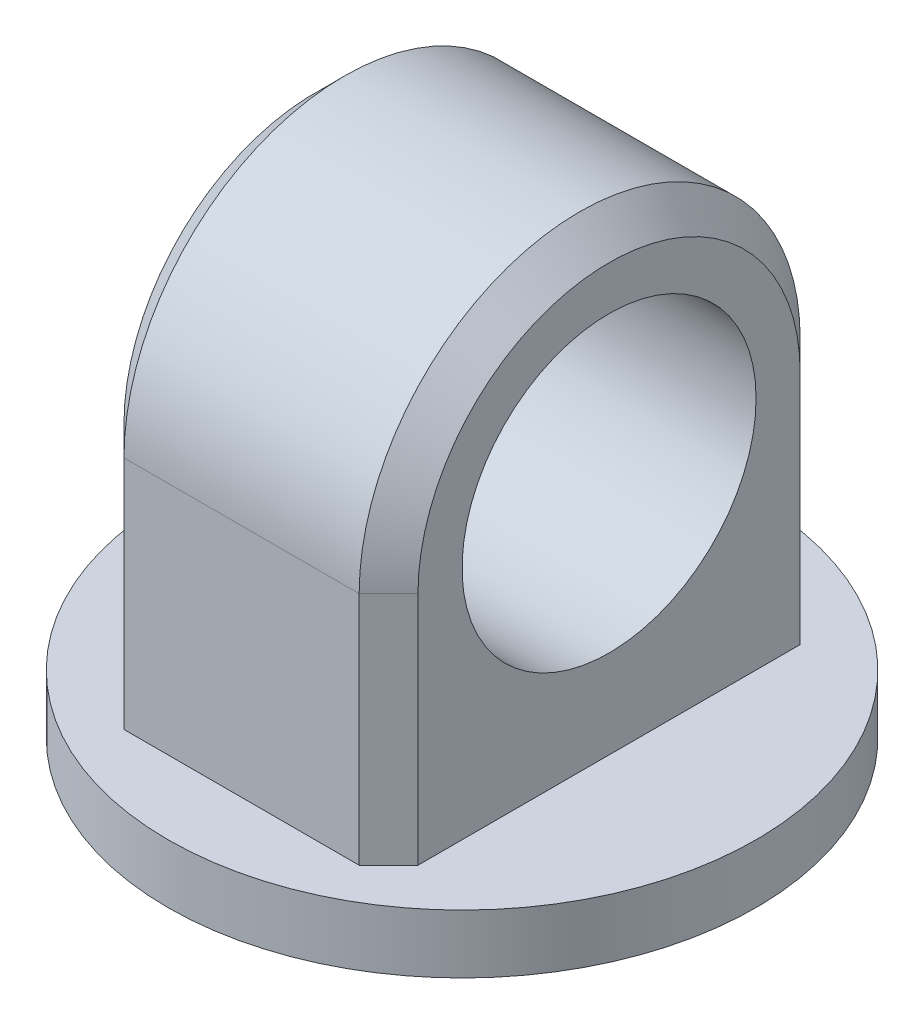
ISO-10303-21;
HEADER;
FILE_DESCRIPTION(('STEP AP214'),'2;1');
FILE_NAME('part.step','',(''),(''),'','','');
FILE_SCHEMA(('AUTOMOTIVE_DESIGN { 1 0 10303 214 1 1 1 1 }'));
ENDSEC;
DATA;
#1=APPLICATION_CONTEXT('core data for automotive mechanical design processes');
#2=APPLICATION_PROTOCOL_DEFINITION('international standard','automotive_design',2000,#1);
#3=PRODUCT_CONTEXT('',#1,'mechanical');
#4=PRODUCT('Part','Part','',(#3));
#5=PRODUCT_RELATED_PRODUCT_CATEGORY('part','',(#4));
#6=PRODUCT_DEFINITION_FORMATION('','',#4);
#7=PRODUCT_DEFINITION_CONTEXT('part definition',#1,'design');
#8=PRODUCT_DEFINITION('design','',#6,#7);
#9=PRODUCT_DEFINITION_SHAPE('','',#8);
#10=(LENGTH_UNIT() NAMED_UNIT(*) SI_UNIT(.MILLI.,.METRE.));
#11=(NAMED_UNIT(*) PLANE_ANGLE_UNIT() SI_UNIT($,.RADIAN.));
#12=(NAMED_UNIT(*) SI_UNIT($,.STERADIAN.) SOLID_ANGLE_UNIT());
#13=UNCERTAINTY_MEASURE_WITH_UNIT(LENGTH_MEASURE(1.E-05),#10,'distance_accuracy_value','');
#14=(GEOMETRIC_REPRESENTATION_CONTEXT(3) GLOBAL_UNCERTAINTY_ASSIGNED_CONTEXT((#13)) GLOBAL_UNIT_ASSIGNED_CONTEXT((#10,
#11,#12)) REPRESENTATION_CONTEXT('',''));
#15=CARTESIAN_POINT('',(0.,0.,0.));
#16=DIRECTION('',(0.,0.,1.));
#17=DIRECTION('',(1.,0.,0.));
#18=AXIS2_PLACEMENT_3D('',#15,#16,#17);
#19=CARTESIAN_POINT('',(-25.,90.,-37.5));
#20=DIRECTION('',(0.,0.,1.));
#21=DIRECTION('',(1.,0.,0.));
#22=AXIS2_PLACEMENT_3D('',#19,#20,#21);
#23=PLANE('',#22);
#24=DIRECTION('',(-1.,0.,0.));
#25=VECTOR('',#24,1.);
#26=CARTESIAN_POINT('',(-25.,10.,-37.5));
#27=LINE('',#26,#25);
#28=CARTESIAN_POINT('',(20.,10.,-37.5));
#29=VERTEX_POINT('',#28);
#30=CARTESIAN_POINT('',(-20.,10.,-37.5));
#31=VERTEX_POINT('',#30);
#32=EDGE_CURVE('E176',#29,#31,#27,.T.);
#33=ORIENTED_EDGE('',*,*,#32,.T.);
#34=DIRECTION('',(0.,1.,0.));
#35=VECTOR('',#34,1.);
#36=CARTESIAN_POINT('',(-20.,90.,-37.5));
#37=LINE('',#36,#35);
#38=CARTESIAN_POINT('',(-20.,50.,-37.5));
#39=VERTEX_POINT('',#38);
#40=EDGE_CURVE('E152',#31,#39,#37,.T.);
#41=ORIENTED_EDGE('',*,*,#40,.T.);
#42=DIRECTION('',(1.,0.,0.));
#43=VECTOR('',#42,1.);
#44=CARTESIAN_POINT('',(-50.,50.,-37.5));
#45=LINE('',#44,#43);
#46=CARTESIAN_POINT('',(20.,50.,-37.5));
#47=VERTEX_POINT('',#46);
#48=EDGE_CURVE('E111',#39,#47,#45,.T.);
#49=ORIENTED_EDGE('',*,*,#48,.T.);
#50=DIRECTION('',(0.,-1.,0.));
#51=VECTOR('',#50,1.);
#52=CARTESIAN_POINT('',(20.,90.,-37.5));
#53=LINE('',#52,#51);
#54=EDGE_CURVE('E150',#47,#29,#53,.T.);
#55=ORIENTED_EDGE('',*,*,#54,.T.);
#56=EDGE_LOOP('',(#33,#41,#49,#55));
#57=FACE_BOUND('',#56,.T.);
#58=ADVANCED_FACE('F36',(#57),#23,.F.);
#59=CARTESIAN_POINT('',(0.,10.,0.));
#60=DIRECTION('',(0.,-1.,0.));
#61=DIRECTION('',(0.,0.,-1.));
#62=AXIS2_PLACEMENT_3D('',#59,#60,#61);
#63=CYLINDRICAL_SURFACE('',#62,50.);
#64=CARTESIAN_POINT('',(0.,10.,0.));
#65=DIRECTION('',(0.,1.,0.));
#66=DIRECTION('',(0.,0.,1.));
#67=AXIS2_PLACEMENT_3D('',#64,#65,#66);
#68=CIRCLE('',#67,50.);
#69=CARTESIAN_POINT('',(0.,10.,50.));
#70=VERTEX_POINT('',#69);
#71=EDGE_CURVE('E143',#70,#70,#68,.T.);
#72=ORIENTED_EDGE('',*,*,#71,.F.);
#73=EDGE_LOOP('',(#72));
#74=FACE_BOUND('',#73,.T.);
#75=CARTESIAN_POINT('',(0.,0.,0.));
#76=DIRECTION('',(0.,1.,0.));
#77=DIRECTION('',(0.,0.,1.));
#78=AXIS2_PLACEMENT_3D('',#75,#76,#77);
#79=CIRCLE('',#78,50.);
#80=CARTESIAN_POINT('',(0.,0.,50.));
#81=VERTEX_POINT('',#80);
#82=EDGE_CURVE('E195',#81,#81,#79,.T.);
#83=ORIENTED_EDGE('',*,*,#82,.T.);
#84=EDGE_LOOP('',(#83));
#85=FACE_BOUND('',#84,.T.);
#86=ADVANCED_FACE('F225',(#74,#85),#63,.T.);
#87=CARTESIAN_POINT('',(0.,10.,0.));
#88=DIRECTION('',(0.,1.,0.));
#89=DIRECTION('',(0.,0.,1.));
#90=AXIS2_PLACEMENT_3D('',#87,#88,#89);
#91=PLANE('',#90);
#92=DIRECTION('',(0.,0.,-1.));
#93=VECTOR('',#92,1.);
#94=CARTESIAN_POINT('',(25.,10.,-37.5));
#95=LINE('',#94,#93);
#96=CARTESIAN_POINT('',(25.,10.,32.5));
#97=VERTEX_POINT('',#96);
#98=CARTESIAN_POINT('',(25.,10.,-32.5));
#99=VERTEX_POINT('',#98);
#100=EDGE_CURVE('E185',#97,#99,#95,.T.);
#101=ORIENTED_EDGE('',*,*,#100,.F.);
#102=DIRECTION('',(0.707106781186547,0.,-0.707106781186549));
#103=VECTOR('',#102,1.);
#104=CARTESIAN_POINT('',(25.,9.99999999999999,32.5));
#105=LINE('',#104,#103);
#106=CARTESIAN_POINT('',(20.,10.,37.5));
#107=VERTEX_POINT('',#106);
#108=EDGE_CURVE('E46',#97,#107,#105,.F.);
#109=ORIENTED_EDGE('',*,*,#108,.T.);
#110=DIRECTION('',(1.,0.,0.));
#111=VECTOR('',#110,1.);
#112=CARTESIAN_POINT('',(-25.,10.,37.5));
#113=LINE('',#112,#111);
#114=CARTESIAN_POINT('',(-20.,10.,37.5));
#115=VERTEX_POINT('',#114);
#116=EDGE_CURVE('E188',#115,#107,#113,.T.);
#117=ORIENTED_EDGE('',*,*,#116,.F.);
#118=DIRECTION('',(0.707106781186549,0.,0.707106781186546));
#119=VECTOR('',#118,1.);
#120=CARTESIAN_POINT('',(-20.,9.99999999999999,37.5));
#121=LINE('',#120,#119);
#122=CARTESIAN_POINT('',(-25.,10.,32.5));
#123=VERTEX_POINT('',#122);
#124=EDGE_CURVE('E139',#115,#123,#121,.F.);
#125=ORIENTED_EDGE('',*,*,#124,.T.);
#126=DIRECTION('',(0.,0.,1.));
#127=VECTOR('',#126,1.);
#128=CARTESIAN_POINT('',(-25.,10.,-37.5));
#129=LINE('',#128,#127);
#130=CARTESIAN_POINT('',(-25.,10.,-32.5));
#131=VERTEX_POINT('',#130);
#132=EDGE_CURVE('E184',#131,#123,#129,.T.);
#133=ORIENTED_EDGE('',*,*,#132,.F.);
#134=DIRECTION('',(-0.707106781186549,0.,0.707106781186546));
#135=VECTOR('',#134,1.);
#136=CARTESIAN_POINT('',(-25.,9.99999999999999,-32.5));
#137=LINE('',#136,#135);
#138=EDGE_CURVE('E160',#131,#31,#137,.F.);
#139=ORIENTED_EDGE('',*,*,#138,.T.);
#140=ORIENTED_EDGE('',*,*,#32,.F.);
#141=DIRECTION('',(-0.707106781186547,0.,-0.707106781186549));
#142=VECTOR('',#141,1.);
#143=CARTESIAN_POINT('',(20.,9.99999999999999,-37.5));
#144=LINE('',#143,#142);
#145=EDGE_CURVE('E11',#29,#99,#144,.F.);
#146=ORIENTED_EDGE('',*,*,#145,.T.);
#147=EDGE_LOOP('',(#101,#109,#117,#125,#133,#139,#140,#146));
#148=FACE_BOUND('',#147,.T.);
#149=ORIENTED_EDGE('',*,*,#71,.T.);
#150=EDGE_LOOP('',(#149));
#151=FACE_BOUND('',#150,.T.);
#152=ADVANCED_FACE('F180',(#148,#151),#91,.T.);
#153=CARTESIAN_POINT('',(0.,0.,0.));
#154=DIRECTION('',(0.,1.,0.));
#155=DIRECTION('',(0.,0.,1.));
#156=AXIS2_PLACEMENT_3D('',#153,#154,#155);
#157=PLANE('',#156);
#158=ORIENTED_EDGE('',*,*,#82,.F.);
#159=EDGE_LOOP('',(#158));
#160=FACE_BOUND('',#159,.T.);
#161=ADVANCED_FACE('F212',(#160),#157,.F.);
#162=CARTESIAN_POINT('',(25.,90.,-37.5));
#163=DIRECTION('',(-1.,0.,0.));
#164=DIRECTION('',(0.,0.,1.));
#165=AXIS2_PLACEMENT_3D('',#162,#163,#164);
#166=PLANE('',#165);
#167=CARTESIAN_POINT('',(25.,50.,0.));
#168=DIRECTION('',(1.,0.,0.));
#169=DIRECTION('',(0.,0.,-1.));
#170=AXIS2_PLACEMENT_3D('',#167,#168,#169);
#171=CIRCLE('',#170,25.);
#172=CARTESIAN_POINT('',(25.,50.,-25.));
#173=VERTEX_POINT('',#172);
#174=EDGE_CURVE('E127',#173,#173,#171,.T.);
#175=ORIENTED_EDGE('',*,*,#174,.F.);
#176=EDGE_LOOP('',(#175));
#177=FACE_BOUND('',#176,.T.);
#178=CARTESIAN_POINT('',(25.,50.,0.));
#179=DIRECTION('',(-1.,0.,0.));
#180=DIRECTION('',(0.,0.,1.));
#181=AXIS2_PLACEMENT_3D('',#178,#179,#180);
#182=CIRCLE('',#181,32.5);
#183=CARTESIAN_POINT('',(25.,50.,-32.5));
#184=VERTEX_POINT('',#183);
#185=CARTESIAN_POINT('',(25.,50.,32.5));
#186=VERTEX_POINT('',#185);
#187=EDGE_CURVE('E54',#184,#186,#182,.F.);
#188=ORIENTED_EDGE('',*,*,#187,.T.);
#189=DIRECTION('',(0.,-1.,0.));
#190=VECTOR('',#189,1.);
#191=CARTESIAN_POINT('',(25.,90.,32.5));
#192=LINE('',#191,#190);
#193=EDGE_CURVE('E157',#186,#97,#192,.T.);
#194=ORIENTED_EDGE('',*,*,#193,.T.);
#195=ORIENTED_EDGE('',*,*,#100,.T.);
#196=DIRECTION('',(0.,1.,0.));
#197=VECTOR('',#196,1.);
#198=CARTESIAN_POINT('',(25.,90.,-32.5));
#199=LINE('',#198,#197);
#200=EDGE_CURVE('E59',#99,#184,#199,.T.);
#201=ORIENTED_EDGE('',*,*,#200,.T.);
#202=EDGE_LOOP('',(#188,#194,#195,#201));
#203=FACE_BOUND('',#202,.T.);
#204=ADVANCED_FACE('F209',(#177,#203),#166,.F.);
#205=CARTESIAN_POINT('',(-25.,90.,-37.5));
#206=DIRECTION('',(1.,0.,0.));
#207=DIRECTION('',(0.,0.,-1.));
#208=AXIS2_PLACEMENT_3D('',#205,#206,#207);
#209=PLANE('',#208);
#210=ORIENTED_EDGE('',*,*,#132,.T.);
#211=DIRECTION('',(0.,1.,0.));
#212=VECTOR('',#211,1.);
#213=CARTESIAN_POINT('',(-25.,90.,32.5));
#214=LINE('',#213,#212);
#215=CARTESIAN_POINT('',(-25.,50.,32.5));
#216=VERTEX_POINT('',#215);
#217=EDGE_CURVE('E148',#123,#216,#214,.T.);
#218=ORIENTED_EDGE('',*,*,#217,.T.);
#219=CARTESIAN_POINT('',(-25.,50.,0.));
#220=DIRECTION('',(1.,0.,0.));
#221=DIRECTION('',(0.,0.,-1.));
#222=AXIS2_PLACEMENT_3D('',#219,#220,#221);
#223=CIRCLE('',#222,32.5);
#224=CARTESIAN_POINT('',(-25.,50.,-32.5));
#225=VERTEX_POINT('',#224);
#226=EDGE_CURVE('E133',#216,#225,#223,.F.);
#227=ORIENTED_EDGE('',*,*,#226,.T.);
#228=DIRECTION('',(0.,-1.,0.));
#229=VECTOR('',#228,1.);
#230=CARTESIAN_POINT('',(-25.,90.,-32.5));
#231=LINE('',#230,#229);
#232=EDGE_CURVE('E141',#225,#131,#231,.T.);
#233=ORIENTED_EDGE('',*,*,#232,.T.);
#234=EDGE_LOOP('',(#210,#218,#227,#233));
#235=FACE_BOUND('',#234,.T.);
#236=CARTESIAN_POINT('',(-25.,50.,0.));
#237=DIRECTION('',(1.,0.,0.));
#238=DIRECTION('',(0.,0.,-1.));
#239=AXIS2_PLACEMENT_3D('',#236,#237,#238);
#240=CIRCLE('',#239,25.);
#241=CARTESIAN_POINT('',(-25.,50.,-25.));
#242=VERTEX_POINT('',#241);
#243=EDGE_CURVE('E190',#242,#242,#240,.T.);
#244=ORIENTED_EDGE('',*,*,#243,.T.);
#245=EDGE_LOOP('',(#244));
#246=FACE_BOUND('',#245,.T.);
#247=ADVANCED_FACE('F211',(#235,#246),#209,.F.);
#248=CARTESIAN_POINT('',(-25.,90.,37.5));
#249=DIRECTION('',(0.,0.,-1.));
#250=DIRECTION('',(-1.,0.,0.));
#251=AXIS2_PLACEMENT_3D('',#248,#249,#250);
#252=PLANE('',#251);
#253=DIRECTION('',(1.,0.,0.));
#254=VECTOR('',#253,1.);
#255=CARTESIAN_POINT('',(-50.,50.,37.5));
#256=LINE('',#255,#254);
#257=CARTESIAN_POINT('',(-20.,50.,37.5));
#258=VERTEX_POINT('',#257);
#259=CARTESIAN_POINT('',(20.,50.,37.5));
#260=VERTEX_POINT('',#259);
#261=EDGE_CURVE('E108',#258,#260,#256,.T.);
#262=ORIENTED_EDGE('',*,*,#261,.F.);
#263=DIRECTION('',(0.,-1.,0.));
#264=VECTOR('',#263,1.);
#265=CARTESIAN_POINT('',(-20.,90.,37.5));
#266=LINE('',#265,#264);
#267=EDGE_CURVE('E123',#258,#115,#266,.T.);
#268=ORIENTED_EDGE('',*,*,#267,.T.);
#269=ORIENTED_EDGE('',*,*,#116,.T.);
#270=DIRECTION('',(0.,1.,0.));
#271=VECTOR('',#270,1.);
#272=CARTESIAN_POINT('',(20.,90.,37.5));
#273=LINE('',#272,#271);
#274=EDGE_CURVE('E126',#107,#260,#273,.T.);
#275=ORIENTED_EDGE('',*,*,#274,.T.);
#276=EDGE_LOOP('',(#262,#268,#269,#275));
#277=FACE_BOUND('',#276,.T.);
#278=ADVANCED_FACE('F120',(#277),#252,.F.);
#279=CARTESIAN_POINT('',(-50.,50.,0.));
#280=DIRECTION('',(1.,0.,0.));
#281=DIRECTION('',(0.,0.,-1.));
#282=AXIS2_PLACEMENT_3D('',#279,#280,#281);
#283=CYLINDRICAL_SURFACE('',#282,25.);
#284=ORIENTED_EDGE('',*,*,#174,.T.);
#285=EDGE_LOOP('',(#284));
#286=FACE_BOUND('',#285,.T.);
#287=ORIENTED_EDGE('',*,*,#243,.F.);
#288=EDGE_LOOP('',(#287));
#289=FACE_BOUND('',#288,.T.);
#290=ADVANCED_FACE('F206',(#286,#289),#283,.F.);
#291=CARTESIAN_POINT('',(-50.,50.,0.));
#292=DIRECTION('',(1.,0.,0.));
#293=DIRECTION('',(0.,0.,-1.));
#294=AXIS2_PLACEMENT_3D('',#291,#292,#293);
#295=CYLINDRICAL_SURFACE('',#294,37.5);
#296=ORIENTED_EDGE('',*,*,#48,.F.);
#297=CARTESIAN_POINT('',(-20.,50.,0.));
#298=DIRECTION('',(1.,0.,0.));
#299=DIRECTION('',(0.,0.,-1.));
#300=AXIS2_PLACEMENT_3D('',#297,#298,#299);
#301=CIRCLE('',#300,37.5);
#302=EDGE_CURVE('E105',#39,#258,#301,.T.);
#303=ORIENTED_EDGE('',*,*,#302,.T.);
#304=ORIENTED_EDGE('',*,*,#261,.T.);
#305=CARTESIAN_POINT('',(20.,50.,0.));
#306=DIRECTION('',(-1.,0.,0.));
#307=DIRECTION('',(0.,0.,1.));
#308=AXIS2_PLACEMENT_3D('',#305,#306,#307);
#309=CIRCLE('',#308,37.5);
#310=EDGE_CURVE('E116',#260,#47,#309,.T.);
#311=ORIENTED_EDGE('',*,*,#310,.T.);
#312=EDGE_LOOP('',(#296,#303,#304,#311));
#313=FACE_BOUND('',#312,.T.);
#314=ADVANCED_FACE('F107',(#313),#295,.T.);
#315=CARTESIAN_POINT('',(-25.,90.,-32.5));
#316=DIRECTION('',(0.707106781186546,0.,0.707106781186549));
#317=DIRECTION('',(0.,-1.,0.));
#318=AXIS2_PLACEMENT_3D('',#315,#316,#317);
#319=PLANE('',#318);
#320=ORIENTED_EDGE('',*,*,#138,.F.);
#321=ORIENTED_EDGE('',*,*,#232,.F.);
#322=DIRECTION('',(-0.707106781186549,0.,0.707106781186546));
#323=VECTOR('',#322,1.);
#324=CARTESIAN_POINT('',(-20.,50.,-37.5));
#325=LINE('',#324,#323);
#326=EDGE_CURVE('E136',#39,#225,#325,.T.);
#327=ORIENTED_EDGE('',*,*,#326,.F.);
#328=ORIENTED_EDGE('',*,*,#40,.F.);
#329=EDGE_LOOP('',(#320,#321,#327,#328));
#330=FACE_BOUND('',#329,.T.);
#331=ADVANCED_FACE('F237',(#330),#319,.F.);
#332=CARTESIAN_POINT('',(-25.,50.,0.));
#333=DIRECTION('',(1.,0.,0.));
#334=DIRECTION('',(0.,0.,-1.));
#335=AXIS2_PLACEMENT_3D('',#332,#333,#334);
#336=CONICAL_SURFACE('',#335,32.5,0.785398163397446);
#337=ORIENTED_EDGE('',*,*,#326,.T.);
#338=ORIENTED_EDGE('',*,*,#226,.F.);
#339=DIRECTION('',(-0.707106781186549,0.,-0.707106781186546));
#340=VECTOR('',#339,1.);
#341=CARTESIAN_POINT('',(-20.,50.,37.5));
#342=LINE('',#341,#340);
#343=EDGE_CURVE('E131',#258,#216,#342,.T.);
#344=ORIENTED_EDGE('',*,*,#343,.F.);
#345=ORIENTED_EDGE('',*,*,#302,.F.);
#346=EDGE_LOOP('',(#337,#338,#344,#345));
#347=FACE_BOUND('',#346,.T.);
#348=ADVANCED_FACE('F132',(#347),#336,.T.);
#349=CARTESIAN_POINT('',(-20.,90.,37.5));
#350=DIRECTION('',(0.707106781186546,0.,-0.707106781186549));
#351=DIRECTION('',(0.,-1.,0.));
#352=AXIS2_PLACEMENT_3D('',#349,#350,#351);
#353=PLANE('',#352);
#354=ORIENTED_EDGE('',*,*,#343,.T.);
#355=ORIENTED_EDGE('',*,*,#217,.F.);
#356=ORIENTED_EDGE('',*,*,#124,.F.);
#357=ORIENTED_EDGE('',*,*,#267,.F.);
#358=EDGE_LOOP('',(#354,#355,#356,#357));
#359=FACE_BOUND('',#358,.T.);
#360=ADVANCED_FACE('F138',(#359),#353,.F.);
#361=CARTESIAN_POINT('',(20.,90.,-37.5));
#362=DIRECTION('',(-0.707106781186549,0.,0.707106781186547));
#363=DIRECTION('',(0.,-1.,0.));
#364=AXIS2_PLACEMENT_3D('',#361,#362,#363);
#365=PLANE('',#364);
#366=ORIENTED_EDGE('',*,*,#145,.F.);
#367=ORIENTED_EDGE('',*,*,#54,.F.);
#368=DIRECTION('',(-0.707106781186547,0.,-0.707106781186549));
#369=VECTOR('',#368,1.);
#370=CARTESIAN_POINT('',(25.,50.,-32.5));
#371=LINE('',#370,#369);
#372=EDGE_CURVE('E41',#184,#47,#371,.T.);
#373=ORIENTED_EDGE('',*,*,#372,.F.);
#374=ORIENTED_EDGE('',*,*,#200,.F.);
#375=EDGE_LOOP('',(#366,#367,#373,#374));
#376=FACE_BOUND('',#375,.T.);
#377=ADVANCED_FACE('F39',(#376),#365,.F.);
#378=CARTESIAN_POINT('',(20.,50.,0.));
#379=DIRECTION('',(-1.,0.,0.));
#380=DIRECTION('',(0.,0.,1.));
#381=AXIS2_PLACEMENT_3D('',#378,#379,#380);
#382=CONICAL_SURFACE('',#381,37.5,0.785398163397449);
#383=ORIENTED_EDGE('',*,*,#372,.T.);
#384=ORIENTED_EDGE('',*,*,#310,.F.);
#385=DIRECTION('',(-0.707106781186546,0.,0.707106781186549));
#386=VECTOR('',#385,1.);
#387=CARTESIAN_POINT('',(25.,50.,32.5));
#388=LINE('',#387,#386);
#389=EDGE_CURVE('E163',#186,#260,#388,.T.);
#390=ORIENTED_EDGE('',*,*,#389,.F.);
#391=ORIENTED_EDGE('',*,*,#187,.F.);
#392=EDGE_LOOP('',(#383,#384,#390,#391));
#393=FACE_BOUND('',#392,.T.);
#394=ADVANCED_FACE('F169',(#393),#382,.T.);
#395=CARTESIAN_POINT('',(25.,90.,32.5));
#396=DIRECTION('',(-0.707106781186549,0.,-0.707106781186547));
#397=DIRECTION('',(0.,-1.,0.));
#398=AXIS2_PLACEMENT_3D('',#395,#396,#397);
#399=PLANE('',#398);
#400=ORIENTED_EDGE('',*,*,#389,.T.);
#401=ORIENTED_EDGE('',*,*,#274,.F.);
#402=ORIENTED_EDGE('',*,*,#108,.F.);
#403=ORIENTED_EDGE('',*,*,#193,.F.);
#404=EDGE_LOOP('',(#400,#401,#402,#403));
#405=FACE_BOUND('',#404,.T.);
#406=ADVANCED_FACE('F254',(#405),#399,.F.);
#407=CLOSED_SHELL('',(#58,#86,#152,#161,#204,#247,#278,#290,#314,#331,#348,#360,#377,#394,#406));
#408=MANIFOLD_SOLID_BREP('B2',#407);
#409=ADVANCED_BREP_SHAPE_REPRESENTATION('',(#18,#408),#14);
#410=SHAPE_DEFINITION_REPRESENTATION(#9,#409);
ENDSEC;
END-ISO-10303-21;
